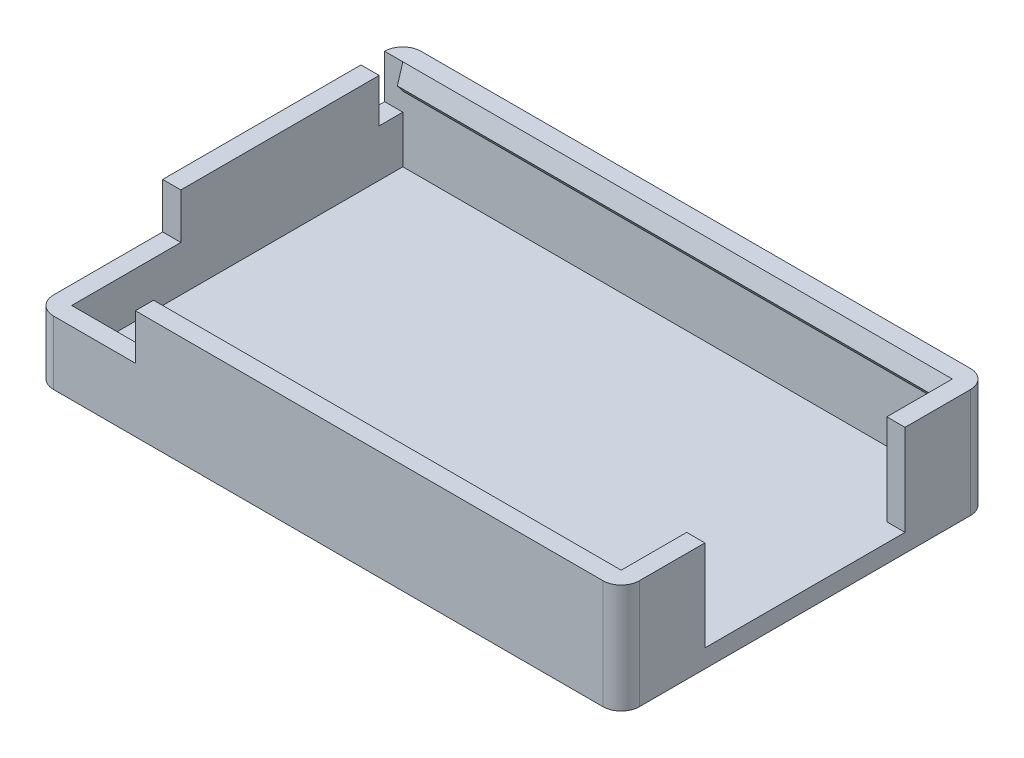
ISO-10303-21;
HEADER;
FILE_DESCRIPTION(('STEP AP214'),'2;1');
FILE_NAME('part.step','',(''),(''),'','','');
FILE_SCHEMA(('AUTOMOTIVE_DESIGN { 1 0 10303 214 1 1 1 1 }'));
ENDSEC;
DATA;
#1=APPLICATION_CONTEXT('core data for automotive mechanical design processes');
#2=APPLICATION_PROTOCOL_DEFINITION('international standard','automotive_design',2000,#1);
#3=PRODUCT_CONTEXT('',#1,'mechanical');
#4=PRODUCT('Part','Part','',(#3));
#5=PRODUCT_RELATED_PRODUCT_CATEGORY('part','',(#4));
#6=PRODUCT_DEFINITION_FORMATION('','',#4);
#7=PRODUCT_DEFINITION_CONTEXT('part definition',#1,'design');
#8=PRODUCT_DEFINITION('design','',#6,#7);
#9=PRODUCT_DEFINITION_SHAPE('','',#8);
#10=(LENGTH_UNIT() NAMED_UNIT(*) SI_UNIT(.MILLI.,.METRE.));
#11=(NAMED_UNIT(*) PLANE_ANGLE_UNIT() SI_UNIT($,.RADIAN.));
#12=(NAMED_UNIT(*) SI_UNIT($,.STERADIAN.) SOLID_ANGLE_UNIT());
#13=UNCERTAINTY_MEASURE_WITH_UNIT(LENGTH_MEASURE(1.E-05),#10,'distance_accuracy_value','');
#14=(GEOMETRIC_REPRESENTATION_CONTEXT(3) GLOBAL_UNCERTAINTY_ASSIGNED_CONTEXT((#13)) GLOBAL_UNIT_ASSIGNED_CONTEXT((#10,
#11,#12)) REPRESENTATION_CONTEXT('',''));
#15=CARTESIAN_POINT('',(0.,0.,0.));
#16=DIRECTION('',(0.,0.,1.));
#17=DIRECTION('',(1.,0.,0.));
#18=AXIS2_PLACEMENT_3D('',#15,#16,#17);
#19=CARTESIAN_POINT('',(-15.1,3.5,9.1));
#20=DIRECTION('',(-1.,0.,0.));
#21=DIRECTION('',(0.,0.,1.));
#22=AXIS2_PLACEMENT_3D('',#19,#20,#21);
#23=PLANE('',#22);
#24=DIRECTION('',(0.,1.,0.));
#25=VECTOR('',#24,1.);
#26=CARTESIAN_POINT('',(-15.1,6.,-7.8));
#27=LINE('',#26,#25);
#28=CARTESIAN_POINT('',(-15.1,3.6,-7.8));
#29=VERTEX_POINT('',#28);
#30=CARTESIAN_POINT('',(-15.1,6.,-7.8));
#31=VERTEX_POINT('',#30);
#32=EDGE_CURVE('E240',#29,#31,#27,.T.);
#33=ORIENTED_EDGE('',*,*,#32,.T.);
#34=DIRECTION('',(0.,0.,-1.));
#35=VECTOR('',#34,1.);
#36=CARTESIAN_POINT('',(-15.1,6.,3.1));
#37=LINE('',#36,#35);
#38=CARTESIAN_POINT('',(-15.1,6.,3.1));
#39=VERTEX_POINT('',#38);
#40=EDGE_CURVE('E361',#39,#31,#37,.T.);
#41=ORIENTED_EDGE('',*,*,#40,.F.);
#42=DIRECTION('',(0.,-1.,0.));
#43=VECTOR('',#42,1.);
#44=CARTESIAN_POINT('',(-15.1,6.,3.1));
#45=LINE('',#44,#43);
#46=CARTESIAN_POINT('',(-15.1,3.5,3.1));
#47=VERTEX_POINT('',#46);
#48=EDGE_CURVE('E371',#39,#47,#45,.T.);
#49=ORIENTED_EDGE('',*,*,#48,.T.);
#50=DIRECTION('',(0.,0.,-1.));
#51=VECTOR('',#50,1.);
#52=CARTESIAN_POINT('',(-15.1,3.5,9.1));
#53=LINE('',#52,#51);
#54=CARTESIAN_POINT('',(-15.1,3.5,9.1));
#55=VERTEX_POINT('',#54);
#56=EDGE_CURVE('E394',#55,#47,#53,.T.);
#57=ORIENTED_EDGE('',*,*,#56,.F.);
#58=DIRECTION('',(0.,-1.,0.));
#59=VECTOR('',#58,1.);
#60=CARTESIAN_POINT('',(-15.1,3.5,9.1));
#61=LINE('',#60,#59);
#62=CARTESIAN_POINT('',(-15.1,1.,9.1));
#63=VERTEX_POINT('',#62);
#64=EDGE_CURVE('E435',#55,#63,#61,.T.);
#65=ORIENTED_EDGE('',*,*,#64,.T.);
#66=DIRECTION('',(0.,0.,-1.));
#67=VECTOR('',#66,1.);
#68=CARTESIAN_POINT('',(-15.1,1.,9.1));
#69=LINE('',#68,#67);
#70=CARTESIAN_POINT('',(-15.1,1.,-9.1));
#71=VERTEX_POINT('',#70);
#72=EDGE_CURVE('E409',#63,#71,#69,.T.);
#73=ORIENTED_EDGE('',*,*,#72,.T.);
#74=DIRECTION('',(0.,-1.,0.));
#75=VECTOR('',#74,1.);
#76=CARTESIAN_POINT('',(-15.1,3.5,-9.1));
#77=LINE('',#76,#75);
#78=CARTESIAN_POINT('',(-15.1,3.6,-9.1));
#79=VERTEX_POINT('',#78);
#80=EDGE_CURVE('E250',#79,#71,#77,.T.);
#81=ORIENTED_EDGE('',*,*,#80,.F.);
#82=DIRECTION('',(0.,0.,1.));
#83=VECTOR('',#82,1.);
#84=CARTESIAN_POINT('',(-15.1,3.6,-7.8));
#85=LINE('',#84,#83);
#86=EDGE_CURVE('E229',#79,#29,#85,.T.);
#87=ORIENTED_EDGE('',*,*,#86,.T.);
#88=EDGE_LOOP('',(#33,#41,#49,#57,#65,#73,#81,#87));
#89=FACE_BOUND('',#88,.T.);
#90=ADVANCED_FACE('F43',(#89),#23,.F.);
#91=CARTESIAN_POINT('',(-16.1,1.,10.1));
#92=DIRECTION('',(1.,0.,0.));
#93=DIRECTION('',(0.,0.,-1.));
#94=AXIS2_PLACEMENT_3D('',#91,#92,#93);
#95=PLANE('',#94);
#96=DIRECTION('',(0.,-1.,0.));
#97=VECTOR('',#96,1.);
#98=CARTESIAN_POINT('',(-16.1,6.,-7.8));
#99=LINE('',#98,#97);
#100=CARTESIAN_POINT('',(-16.1,6.,-7.8));
#101=VERTEX_POINT('',#100);
#102=CARTESIAN_POINT('',(-16.1,3.6,-7.8));
#103=VERTEX_POINT('',#102);
#104=EDGE_CURVE('E236',#101,#103,#99,.T.);
#105=ORIENTED_EDGE('',*,*,#104,.T.);
#106=DIRECTION('',(0.,0.,-1.));
#107=VECTOR('',#106,1.);
#108=CARTESIAN_POINT('',(-16.1,3.6,-7.8));
#109=LINE('',#108,#107);
#110=CARTESIAN_POINT('',(-16.1,3.6,-9.1));
#111=VERTEX_POINT('',#110);
#112=EDGE_CURVE('E232',#103,#111,#109,.T.);
#113=ORIENTED_EDGE('',*,*,#112,.T.);
#114=DIRECTION('',(0.,-1.,0.));
#115=VECTOR('',#114,1.);
#116=CARTESIAN_POINT('',(-16.1,1.,-9.1));
#117=LINE('',#116,#115);
#118=CARTESIAN_POINT('',(-16.1,0.,-9.1));
#119=VERTEX_POINT('',#118);
#120=EDGE_CURVE('E487',#111,#119,#117,.T.);
#121=ORIENTED_EDGE('',*,*,#120,.T.);
#122=DIRECTION('',(0.,0.,1.));
#123=VECTOR('',#122,1.);
#124=CARTESIAN_POINT('',(-16.1,0.,10.1));
#125=LINE('',#124,#123);
#126=CARTESIAN_POINT('',(-16.1,0.,9.1));
#127=VERTEX_POINT('',#126);
#128=EDGE_CURVE('E462',#119,#127,#125,.T.);
#129=ORIENTED_EDGE('',*,*,#128,.T.);
#130=DIRECTION('',(0.,-1.,0.));
#131=VECTOR('',#130,1.);
#132=CARTESIAN_POINT('',(-16.1,1.,9.1));
#133=LINE('',#132,#131);
#134=CARTESIAN_POINT('',(-16.1,3.5,9.1));
#135=VERTEX_POINT('',#134);
#136=EDGE_CURVE('E491',#127,#135,#133,.F.);
#137=ORIENTED_EDGE('',*,*,#136,.T.);
#138=DIRECTION('',(0.,0.,1.));
#139=VECTOR('',#138,1.);
#140=CARTESIAN_POINT('',(-16.1,3.5,-10.1));
#141=LINE('',#140,#139);
#142=CARTESIAN_POINT('',(-16.1,3.5,3.1));
#143=VERTEX_POINT('',#142);
#144=EDGE_CURVE('E383',#143,#135,#141,.T.);
#145=ORIENTED_EDGE('',*,*,#144,.F.);
#146=DIRECTION('',(0.,-1.,0.));
#147=VECTOR('',#146,1.);
#148=CARTESIAN_POINT('',(-16.1,6.,3.1));
#149=LINE('',#148,#147);
#150=CARTESIAN_POINT('',(-16.1,6.,3.1));
#151=VERTEX_POINT('',#150);
#152=EDGE_CURVE('E378',#151,#143,#149,.T.);
#153=ORIENTED_EDGE('',*,*,#152,.F.);
#154=DIRECTION('',(0.,0.,1.));
#155=VECTOR('',#154,1.);
#156=CARTESIAN_POINT('',(-16.1,6.,-10.1));
#157=LINE('',#156,#155);
#158=EDGE_CURVE('E355',#101,#151,#157,.T.);
#159=ORIENTED_EDGE('',*,*,#158,.F.);
#160=EDGE_LOOP('',(#105,#113,#121,#129,#137,#145,#153,#159));
#161=FACE_BOUND('',#160,.T.);
#162=ADVANCED_FACE('F542',(#161),#95,.F.);
#163=CARTESIAN_POINT('',(0.,6.,0.));
#164=DIRECTION('',(0.,1.,0.));
#165=DIRECTION('',(0.,0.,1.));
#166=AXIS2_PLACEMENT_3D('',#163,#164,#165);
#167=PLANE('',#166);
#168=CARTESIAN_POINT('',(-15.1,6.,-9.1));
#169=DIRECTION('',(0.,1.,0.));
#170=DIRECTION('',(0.,0.,1.));
#171=AXIS2_PLACEMENT_3D('',#168,#169,#170);
#172=CIRCLE('',#171,1.);
#173=CARTESIAN_POINT('',(-15.1,6.,-10.1));
#174=VERTEX_POINT('',#173);
#175=CARTESIAN_POINT('',(-16.1,6.,-9.1));
#176=VERTEX_POINT('',#175);
#177=EDGE_CURVE('E507',#174,#176,#172,.T.);
#178=ORIENTED_EDGE('',*,*,#177,.T.);
#179=DIRECTION('',(1.,0.,0.));
#180=VECTOR('',#179,1.);
#181=CARTESIAN_POINT('',(-18.8294688127912,6.,-9.1));
#182=LINE('',#181,#180);
#183=CARTESIAN_POINT('',(-15.1,6.,-9.1));
#184=VERTEX_POINT('',#183);
#185=EDGE_CURVE('E261',#176,#184,#182,.T.);
#186=ORIENTED_EDGE('',*,*,#185,.T.);
#187=DIRECTION('',(1.,0.,0.));
#188=VECTOR('',#187,1.);
#189=CARTESIAN_POINT('',(-15.1,6.,-9.1));
#190=LINE('',#189,#188);
#191=CARTESIAN_POINT('',(15.1,6.,-9.1));
#192=VERTEX_POINT('',#191);
#193=EDGE_CURVE('E364',#184,#192,#190,.T.);
#194=ORIENTED_EDGE('',*,*,#193,.T.);
#195=DIRECTION('',(0.,0.,1.));
#196=VECTOR('',#195,1.);
#197=CARTESIAN_POINT('',(15.1,6.,-9.1));
#198=LINE('',#197,#196);
#199=CARTESIAN_POINT('',(15.1,6.,-5.5));
#200=VERTEX_POINT('',#199);
#201=EDGE_CURVE('E367',#192,#200,#198,.T.);
#202=ORIENTED_EDGE('',*,*,#201,.T.);
#203=DIRECTION('',(1.,0.,0.));
#204=VECTOR('',#203,1.);
#205=CARTESIAN_POINT('',(15.1,6.,-5.5));
#206=LINE('',#205,#204);
#207=CARTESIAN_POINT('',(16.1,6.,-5.5));
#208=VERTEX_POINT('',#207);
#209=EDGE_CURVE('E344',#200,#208,#206,.T.);
#210=ORIENTED_EDGE('',*,*,#209,.T.);
#211=DIRECTION('',(0.,0.,-1.));
#212=VECTOR('',#211,1.);
#213=CARTESIAN_POINT('',(16.1,6.,-5.5));
#214=LINE('',#213,#212);
#215=CARTESIAN_POINT('',(16.1,6.,-9.1));
#216=VERTEX_POINT('',#215);
#217=EDGE_CURVE('E348',#208,#216,#214,.T.);
#218=ORIENTED_EDGE('',*,*,#217,.T.);
#219=CARTESIAN_POINT('',(15.1,6.,-9.1));
#220=DIRECTION('',(0.,1.,0.));
#221=DIRECTION('',(0.,0.,1.));
#222=AXIS2_PLACEMENT_3D('',#219,#220,#221);
#223=CIRCLE('',#222,1.);
#224=CARTESIAN_POINT('',(15.1,6.,-10.1));
#225=VERTEX_POINT('',#224);
#226=EDGE_CURVE('E504',#216,#225,#223,.T.);
#227=ORIENTED_EDGE('',*,*,#226,.T.);
#228=DIRECTION('',(-1.,0.,0.));
#229=VECTOR('',#228,1.);
#230=CARTESIAN_POINT('',(16.1,6.,-10.1));
#231=LINE('',#230,#229);
#232=EDGE_CURVE('E351',#225,#174,#231,.T.);
#233=ORIENTED_EDGE('',*,*,#232,.T.);
#234=EDGE_LOOP('',(#178,#186,#194,#202,#210,#218,#227,#233));
#235=FACE_BOUND('',#234,.T.);
#236=ADVANCED_FACE('F532',(#235),#167,.T.);
#237=ORIENTED_EDGE('',*,*,#40,.T.);
#238=DIRECTION('',(1.,0.,0.));
#239=VECTOR('',#238,1.);
#240=CARTESIAN_POINT('',(-18.8294688127912,6.,-7.8));
#241=LINE('',#240,#239);
#242=EDGE_CURVE('E237',#101,#31,#241,.T.);
#243=ORIENTED_EDGE('',*,*,#242,.F.);
#244=ORIENTED_EDGE('',*,*,#158,.T.);
#245=DIRECTION('',(1.,0.,0.));
#246=VECTOR('',#245,1.);
#247=CARTESIAN_POINT('',(-16.1,6.,3.1));
#248=LINE('',#247,#246);
#249=EDGE_CURVE('E358',#151,#39,#248,.T.);
#250=ORIENTED_EDGE('',*,*,#249,.T.);
#251=EDGE_LOOP('',(#237,#243,#244,#250));
#252=FACE_BOUND('',#251,.T.);
#253=ADVANCED_FACE('F549',(#252),#167,.T.);
#254=CARTESIAN_POINT('',(-15.1,3.5,-9.1));
#255=DIRECTION('',(0.,0.,-1.));
#256=DIRECTION('',(-1.,0.,0.));
#257=AXIS2_PLACEMENT_3D('',#254,#255,#256);
#258=PLANE('',#257);
#259=DIRECTION('',(-1.,0.,0.));
#260=VECTOR('',#259,1.);
#261=CARTESIAN_POINT('',(16.5317821063276,4.6,-9.10000000000001));
#262=LINE('',#261,#260);
#263=CARTESIAN_POINT('',(15.1,4.6,-9.10000000000001));
#264=VERTEX_POINT('',#263);
#265=CARTESIAN_POINT('',(-15.1,4.60000000000001,-9.1));
#266=VERTEX_POINT('',#265);
#267=EDGE_CURVE('E283',#264,#266,#262,.T.);
#268=ORIENTED_EDGE('',*,*,#267,.T.);
#269=DIRECTION('',(0.,-1.,0.));
#270=VECTOR('',#269,1.);
#271=CARTESIAN_POINT('',(-15.1,3.6,-9.1));
#272=LINE('',#271,#270);
#273=EDGE_CURVE('E247',#184,#266,#272,.T.);
#274=ORIENTED_EDGE('',*,*,#273,.F.);
#275=ORIENTED_EDGE('',*,*,#185,.F.);
#276=EDGE_CURVE('E488',#176,#111,#117,.T.);
#277=ORIENTED_EDGE('',*,*,#276,.T.);
#278=DIRECTION('',(1.,0.,0.));
#279=VECTOR('',#278,1.);
#280=CARTESIAN_POINT('',(-18.8294688127912,3.6,-9.1));
#281=LINE('',#280,#279);
#282=EDGE_CURVE('E258',#111,#79,#281,.T.);
#283=ORIENTED_EDGE('',*,*,#282,.T.);
#284=ORIENTED_EDGE('',*,*,#80,.T.);
#285=DIRECTION('',(1.,0.,0.));
#286=VECTOR('',#285,1.);
#287=CARTESIAN_POINT('',(-15.1,1.,-9.1));
#288=LINE('',#287,#286);
#289=CARTESIAN_POINT('',(15.1,1.,-9.1));
#290=VERTEX_POINT('',#289);
#291=EDGE_CURVE('E412',#71,#290,#288,.T.);
#292=ORIENTED_EDGE('',*,*,#291,.T.);
#293=DIRECTION('',(0.,-1.,0.));
#294=VECTOR('',#293,1.);
#295=CARTESIAN_POINT('',(15.1,3.5,-9.1));
#296=LINE('',#295,#294);
#297=EDGE_CURVE('E430',#264,#290,#296,.T.);
#298=ORIENTED_EDGE('',*,*,#297,.F.);
#299=EDGE_LOOP('',(#268,#274,#275,#277,#283,#284,#292,#298));
#300=FACE_BOUND('',#299,.T.);
#301=ADVANCED_FACE('F539',(#300),#258,.F.);
#302=CARTESIAN_POINT('',(15.1,3.5,-5.5));
#303=DIRECTION('',(1.,0.,0.));
#304=DIRECTION('',(0.,0.,-1.));
#305=AXIS2_PLACEMENT_3D('',#302,#303,#304);
#306=PLANE('',#305);
#307=DIRECTION('',(0.,-0.799999999999993,-0.600000000000009));
#308=VECTOR('',#307,1.);
#309=CARTESIAN_POINT('',(15.1,5.,-8.8));
#310=LINE('',#309,#308);
#311=CARTESIAN_POINT('',(15.1,5.,-8.8));
#312=VERTEX_POINT('',#311);
#313=EDGE_CURVE('E274',#312,#264,#310,.T.);
#314=ORIENTED_EDGE('',*,*,#313,.T.);
#315=ORIENTED_EDGE('',*,*,#297,.T.);
#316=DIRECTION('',(0.,0.,1.));
#317=VECTOR('',#316,1.);
#318=CARTESIAN_POINT('',(15.1,1.,-5.5));
#319=LINE('',#318,#317);
#320=CARTESIAN_POINT('',(15.1,1.,-5.5));
#321=VERTEX_POINT('',#320);
#322=EDGE_CURVE('E416',#290,#321,#319,.T.);
#323=ORIENTED_EDGE('',*,*,#322,.T.);
#324=DIRECTION('',(0.,-1.,0.));
#325=VECTOR('',#324,1.);
#326=CARTESIAN_POINT('',(15.1,3.5,-5.5));
#327=LINE('',#326,#325);
#328=EDGE_CURVE('E426',#200,#321,#327,.T.);
#329=ORIENTED_EDGE('',*,*,#328,.F.);
#330=ORIENTED_EDGE('',*,*,#201,.F.);
#331=DIRECTION('',(0.,-0.95782628522115,0.28734788556635));
#332=VECTOR('',#331,1.);
#333=CARTESIAN_POINT('',(15.1,6.,-9.1));
#334=LINE('',#333,#332);
#335=EDGE_CURVE('E279',#192,#312,#334,.T.);
#336=ORIENTED_EDGE('',*,*,#335,.T.);
#337=EDGE_LOOP('',(#314,#315,#323,#329,#330,#336));
#338=FACE_BOUND('',#337,.T.);
#339=ADVANCED_FACE('F587',(#338),#306,.F.);
#340=CARTESIAN_POINT('',(15.1,3.5,9.1));
#341=DIRECTION('',(1.,0.,0.));
#342=DIRECTION('',(0.,0.,-1.));
#343=AXIS2_PLACEMENT_3D('',#340,#341,#342);
#344=PLANE('',#343);
#345=DIRECTION('',(0.,0.799999999999993,-0.600000000000009));
#346=VECTOR('',#345,1.);
#347=CARTESIAN_POINT('',(15.1,5.,8.8));
#348=LINE('',#347,#346);
#349=CARTESIAN_POINT('',(15.1,4.6,9.10000000000001));
#350=VERTEX_POINT('',#349);
#351=CARTESIAN_POINT('',(15.1,5.,8.8));
#352=VERTEX_POINT('',#351);
#353=EDGE_CURVE('E298',#350,#352,#348,.T.);
#354=ORIENTED_EDGE('',*,*,#353,.T.);
#355=DIRECTION('',(0.,0.95782628522115,0.28734788556635));
#356=VECTOR('',#355,1.);
#357=CARTESIAN_POINT('',(15.1,6.,9.1));
#358=LINE('',#357,#356);
#359=CARTESIAN_POINT('',(15.1,6.,9.1));
#360=VERTEX_POINT('',#359);
#361=EDGE_CURVE('E303',#352,#360,#358,.T.);
#362=ORIENTED_EDGE('',*,*,#361,.T.);
#363=DIRECTION('',(0.,0.,1.));
#364=VECTOR('',#363,1.);
#365=CARTESIAN_POINT('',(15.1,6.,5.5));
#366=LINE('',#365,#364);
#367=CARTESIAN_POINT('',(15.1,6.,5.5));
#368=VERTEX_POINT('',#367);
#369=EDGE_CURVE('E329',#368,#360,#366,.T.);
#370=ORIENTED_EDGE('',*,*,#369,.F.);
#371=DIRECTION('',(0.,-1.,0.));
#372=VECTOR('',#371,1.);
#373=CARTESIAN_POINT('',(15.1,3.5,5.5));
#374=LINE('',#373,#372);
#375=CARTESIAN_POINT('',(15.1,1.,5.5));
#376=VERTEX_POINT('',#375);
#377=EDGE_CURVE('E442',#368,#376,#374,.T.);
#378=ORIENTED_EDGE('',*,*,#377,.T.);
#379=DIRECTION('',(0.,0.,1.));
#380=VECTOR('',#379,1.);
#381=CARTESIAN_POINT('',(15.1,1.,9.1));
#382=LINE('',#381,#380);
#383=CARTESIAN_POINT('',(15.1,1.,9.1));
#384=VERTEX_POINT('',#383);
#385=EDGE_CURVE('E401',#376,#384,#382,.T.);
#386=ORIENTED_EDGE('',*,*,#385,.T.);
#387=DIRECTION('',(0.,-1.,0.));
#388=VECTOR('',#387,1.);
#389=CARTESIAN_POINT('',(15.1,3.5,9.1));
#390=LINE('',#389,#388);
#391=EDGE_CURVE('E439',#350,#384,#390,.T.);
#392=ORIENTED_EDGE('',*,*,#391,.F.);
#393=EDGE_LOOP('',(#354,#362,#370,#378,#386,#392));
#394=FACE_BOUND('',#393,.T.);
#395=ADVANCED_FACE('F609',(#394),#344,.F.);
#396=CARTESIAN_POINT('',(-15.1,3.5,9.1));
#397=DIRECTION('',(0.,0.,1.));
#398=DIRECTION('',(1.,0.,0.));
#399=AXIS2_PLACEMENT_3D('',#396,#397,#398);
#400=PLANE('',#399);
#401=DIRECTION('',(-1.,0.,0.));
#402=VECTOR('',#401,1.);
#403=CARTESIAN_POINT('',(16.5317821063276,4.6,9.10000000000001));
#404=LINE('',#403,#402);
#405=CARTESIAN_POINT('',(-10.6,4.6,9.10000000000001));
#406=VERTEX_POINT('',#405);
#407=EDGE_CURVE('E297',#350,#406,#404,.T.);
#408=ORIENTED_EDGE('',*,*,#407,.F.);
#409=ORIENTED_EDGE('',*,*,#391,.T.);
#410=DIRECTION('',(-1.,0.,0.));
#411=VECTOR('',#410,1.);
#412=CARTESIAN_POINT('',(-15.1,1.,9.1));
#413=LINE('',#412,#411);
#414=EDGE_CURVE('E405',#384,#63,#413,.T.);
#415=ORIENTED_EDGE('',*,*,#414,.T.);
#416=ORIENTED_EDGE('',*,*,#64,.F.);
#417=DIRECTION('',(-1.,0.,0.));
#418=VECTOR('',#417,1.);
#419=CARTESIAN_POINT('',(-15.1,3.5,9.1));
#420=LINE('',#419,#418);
#421=CARTESIAN_POINT('',(-10.6,3.5,9.1));
#422=VERTEX_POINT('',#421);
#423=EDGE_CURVE('E391',#422,#55,#420,.T.);
#424=ORIENTED_EDGE('',*,*,#423,.F.);
#425=DIRECTION('',(0.,-1.,0.));
#426=VECTOR('',#425,1.);
#427=CARTESIAN_POINT('',(-10.6,6.,9.1));
#428=LINE('',#427,#426);
#429=EDGE_CURVE('E340',#406,#422,#428,.T.);
#430=ORIENTED_EDGE('',*,*,#429,.F.);
#431=EDGE_LOOP('',(#408,#409,#415,#416,#424,#430));
#432=FACE_BOUND('',#431,.T.);
#433=ADVANCED_FACE('F578',(#432),#400,.F.);
#434=CARTESIAN_POINT('',(0.,3.5,0.));
#435=DIRECTION('',(0.,-1.,0.));
#436=DIRECTION('',(0.,0.,-1.));
#437=AXIS2_PLACEMENT_3D('',#434,#435,#436);
#438=PLANE('',#437);
#439=ORIENTED_EDGE('',*,*,#144,.T.);
#440=CARTESIAN_POINT('',(-15.1,3.5,9.1));
#441=DIRECTION('',(0.,-1.,0.));
#442=DIRECTION('',(0.,0.,-1.));
#443=AXIS2_PLACEMENT_3D('',#440,#441,#442);
#444=CIRCLE('',#443,1.);
#445=CARTESIAN_POINT('',(-15.1,3.5,10.1));
#446=VERTEX_POINT('',#445);
#447=EDGE_CURVE('E494',#135,#446,#444,.F.);
#448=ORIENTED_EDGE('',*,*,#447,.T.);
#449=DIRECTION('',(1.,0.,0.));
#450=VECTOR('',#449,1.);
#451=CARTESIAN_POINT('',(-16.1,3.5,10.1));
#452=LINE('',#451,#450);
#453=CARTESIAN_POINT('',(-10.6,3.5,10.1));
#454=VERTEX_POINT('',#453);
#455=EDGE_CURVE('E387',#446,#454,#452,.T.);
#456=ORIENTED_EDGE('',*,*,#455,.T.);
#457=DIRECTION('',(0.,0.,1.));
#458=VECTOR('',#457,1.);
#459=CARTESIAN_POINT('',(-10.6,3.5,9.1));
#460=LINE('',#459,#458);
#461=EDGE_CURVE('E302',#422,#454,#460,.T.);
#462=ORIENTED_EDGE('',*,*,#461,.F.);
#463=ORIENTED_EDGE('',*,*,#423,.T.);
#464=ORIENTED_EDGE('',*,*,#56,.T.);
#465=DIRECTION('',(1.,0.,0.));
#466=VECTOR('',#465,1.);
#467=CARTESIAN_POINT('',(-16.1,3.5,3.1));
#468=LINE('',#467,#466);
#469=EDGE_CURVE('E343',#143,#47,#468,.T.);
#470=ORIENTED_EDGE('',*,*,#469,.F.);
#471=EDGE_LOOP('',(#439,#448,#456,#462,#463,#464,#470));
#472=FACE_BOUND('',#471,.T.);
#473=ADVANCED_FACE('F557',(#472),#438,.F.);
#474=CARTESIAN_POINT('',(0.,1.,0.));
#475=DIRECTION('',(0.,-1.,0.));
#476=DIRECTION('',(0.,0.,-1.));
#477=AXIS2_PLACEMENT_3D('',#474,#475,#476);
#478=PLANE('',#477);
#479=DIRECTION('',(1.,0.,0.));
#480=VECTOR('',#479,1.);
#481=CARTESIAN_POINT('',(15.1,1.,-5.5));
#482=LINE('',#481,#480);
#483=CARTESIAN_POINT('',(16.1,1.,-5.5));
#484=VERTEX_POINT('',#483);
#485=EDGE_CURVE('E388',#321,#484,#482,.T.);
#486=ORIENTED_EDGE('',*,*,#485,.F.);
#487=ORIENTED_EDGE('',*,*,#322,.F.);
#488=ORIENTED_EDGE('',*,*,#291,.F.);
#489=ORIENTED_EDGE('',*,*,#72,.F.);
#490=ORIENTED_EDGE('',*,*,#414,.F.);
#491=ORIENTED_EDGE('',*,*,#385,.F.);
#492=DIRECTION('',(-1.,0.,0.));
#493=VECTOR('',#492,1.);
#494=CARTESIAN_POINT('',(15.1,1.,5.5));
#495=LINE('',#494,#493);
#496=CARTESIAN_POINT('',(16.1,1.,5.5));
#497=VERTEX_POINT('',#496);
#498=EDGE_CURVE('E382',#497,#376,#495,.T.);
#499=ORIENTED_EDGE('',*,*,#498,.F.);
#500=DIRECTION('',(0.,0.,-1.));
#501=VECTOR('',#500,1.);
#502=CARTESIAN_POINT('',(16.1,1.,10.1));
#503=LINE('',#502,#501);
#504=EDGE_CURVE('E451',#497,#484,#503,.T.);
#505=ORIENTED_EDGE('',*,*,#504,.T.);
#506=EDGE_LOOP('',(#486,#487,#488,#489,#490,#491,#499,#505));
#507=FACE_BOUND('',#506,.T.);
#508=ADVANCED_FACE('F582',(#507),#478,.F.);
#509=CARTESIAN_POINT('',(16.1,1.,10.1));
#510=DIRECTION('',(-1.,0.,0.));
#511=DIRECTION('',(0.,0.,1.));
#512=AXIS2_PLACEMENT_3D('',#509,#510,#511);
#513=PLANE('',#512);
#514=DIRECTION('',(0.,0.,-1.));
#515=VECTOR('',#514,1.);
#516=CARTESIAN_POINT('',(16.1,6.,10.1));
#517=LINE('',#516,#515);
#518=CARTESIAN_POINT('',(16.1,6.,9.1));
#519=VERTEX_POINT('',#518);
#520=CARTESIAN_POINT('',(16.1,6.,5.5));
#521=VERTEX_POINT('',#520);
#522=EDGE_CURVE('E322',#519,#521,#517,.T.);
#523=ORIENTED_EDGE('',*,*,#522,.F.);
#524=DIRECTION('',(0.,-1.,0.));
#525=VECTOR('',#524,1.);
#526=CARTESIAN_POINT('',(16.1,1.,9.1));
#527=LINE('',#526,#525);
#528=CARTESIAN_POINT('',(16.1,0.,9.1));
#529=VERTEX_POINT('',#528);
#530=EDGE_CURVE('E52',#519,#529,#527,.T.);
#531=ORIENTED_EDGE('',*,*,#530,.T.);
#532=DIRECTION('',(0.,0.,-1.));
#533=VECTOR('',#532,1.);
#534=CARTESIAN_POINT('',(16.1,0.,10.1));
#535=LINE('',#534,#533);
#536=CARTESIAN_POINT('',(16.1,0.,-9.1));
#537=VERTEX_POINT('',#536);
#538=EDGE_CURVE('E450',#529,#537,#535,.T.);
#539=ORIENTED_EDGE('',*,*,#538,.T.);
#540=DIRECTION('',(0.,-1.,0.));
#541=VECTOR('',#540,1.);
#542=CARTESIAN_POINT('',(16.1,1.,-9.1));
#543=LINE('',#542,#541);
#544=EDGE_CURVE('E65',#537,#216,#543,.F.);
#545=ORIENTED_EDGE('',*,*,#544,.T.);
#546=ORIENTED_EDGE('',*,*,#217,.F.);
#547=DIRECTION('',(0.,-1.,0.));
#548=VECTOR('',#547,1.);
#549=CARTESIAN_POINT('',(16.1,3.5,-5.5));
#550=LINE('',#549,#548);
#551=EDGE_CURVE('E397',#208,#484,#550,.T.);
#552=ORIENTED_EDGE('',*,*,#551,.T.);
#553=ORIENTED_EDGE('',*,*,#504,.F.);
#554=DIRECTION('',(0.,-1.,0.));
#555=VECTOR('',#554,1.);
#556=CARTESIAN_POINT('',(16.1,3.5,5.5));
#557=LINE('',#556,#555);
#558=EDGE_CURVE('E446',#521,#497,#557,.T.);
#559=ORIENTED_EDGE('',*,*,#558,.F.);
#560=EDGE_LOOP('',(#523,#531,#539,#545,#546,#552,#553,#559));
#561=FACE_BOUND('',#560,.T.);
#562=ADVANCED_FACE('F516',(#561),#513,.F.);
#563=CARTESIAN_POINT('',(-16.1,1.,-10.1));
#564=DIRECTION('',(0.,0.,1.));
#565=DIRECTION('',(1.,0.,0.));
#566=AXIS2_PLACEMENT_3D('',#563,#564,#565);
#567=PLANE('',#566);
#568=DIRECTION('',(-1.,0.,0.));
#569=VECTOR('',#568,1.);
#570=CARTESIAN_POINT('',(-16.1,0.,-10.1));
#571=LINE('',#570,#569);
#572=CARTESIAN_POINT('',(15.1,0.,-10.1));
#573=VERTEX_POINT('',#572);
#574=CARTESIAN_POINT('',(-15.1,0.,-10.1));
#575=VERTEX_POINT('',#574);
#576=EDGE_CURVE('E458',#573,#575,#571,.T.);
#577=ORIENTED_EDGE('',*,*,#576,.T.);
#578=DIRECTION('',(0.,-1.,0.));
#579=VECTOR('',#578,1.);
#580=CARTESIAN_POINT('',(-15.1,1.,-10.1));
#581=LINE('',#580,#579);
#582=EDGE_CURVE('E501',#575,#174,#581,.F.);
#583=ORIENTED_EDGE('',*,*,#582,.T.);
#584=ORIENTED_EDGE('',*,*,#232,.F.);
#585=DIRECTION('',(0.,-1.,0.));
#586=VECTOR('',#585,1.);
#587=CARTESIAN_POINT('',(15.1,1.,-10.1));
#588=LINE('',#587,#586);
#589=EDGE_CURVE('E497',#225,#573,#588,.T.);
#590=ORIENTED_EDGE('',*,*,#589,.T.);
#591=EDGE_LOOP('',(#577,#583,#584,#590));
#592=FACE_BOUND('',#591,.T.);
#593=ADVANCED_FACE('F528',(#592),#567,.F.);
#594=CARTESIAN_POINT('',(-16.1,1.,10.1));
#595=DIRECTION('',(0.,0.,-1.));
#596=DIRECTION('',(-1.,0.,0.));
#597=AXIS2_PLACEMENT_3D('',#594,#595,#596);
#598=PLANE('',#597);
#599=ORIENTED_EDGE('',*,*,#455,.F.);
#600=DIRECTION('',(0.,-1.,0.));
#601=VECTOR('',#600,1.);
#602=CARTESIAN_POINT('',(-15.1,1.,10.1));
#603=LINE('',#602,#601);
#604=CARTESIAN_POINT('',(-15.1,0.,10.1));
#605=VERTEX_POINT('',#604);
#606=EDGE_CURVE('E471',#446,#605,#603,.T.);
#607=ORIENTED_EDGE('',*,*,#606,.T.);
#608=DIRECTION('',(1.,0.,0.));
#609=VECTOR('',#608,1.);
#610=CARTESIAN_POINT('',(-16.1,0.,10.1));
#611=LINE('',#610,#609);
#612=CARTESIAN_POINT('',(15.1,0.,10.1));
#613=VERTEX_POINT('',#612);
#614=EDGE_CURVE('E455',#605,#613,#611,.T.);
#615=ORIENTED_EDGE('',*,*,#614,.T.);
#616=DIRECTION('',(0.,-1.,0.));
#617=VECTOR('',#616,1.);
#618=CARTESIAN_POINT('',(15.1,1.,10.1));
#619=LINE('',#618,#617);
#620=CARTESIAN_POINT('',(15.1,6.,10.1));
#621=VERTEX_POINT('',#620);
#622=EDGE_CURVE('E454',#613,#621,#619,.F.);
#623=ORIENTED_EDGE('',*,*,#622,.T.);
#624=DIRECTION('',(1.,0.,0.));
#625=VECTOR('',#624,1.);
#626=CARTESIAN_POINT('',(-10.6,6.,10.1));
#627=LINE('',#626,#625);
#628=CARTESIAN_POINT('',(-10.6,6.,10.1));
#629=VERTEX_POINT('',#628);
#630=EDGE_CURVE('E319',#629,#621,#627,.T.);
#631=ORIENTED_EDGE('',*,*,#630,.F.);
#632=DIRECTION('',(0.,-1.,0.));
#633=VECTOR('',#632,1.);
#634=CARTESIAN_POINT('',(-10.6,6.,10.1));
#635=LINE('',#634,#633);
#636=EDGE_CURVE('E333',#629,#454,#635,.T.);
#637=ORIENTED_EDGE('',*,*,#636,.T.);
#638=EDGE_LOOP('',(#599,#607,#615,#623,#631,#637));
#639=FACE_BOUND('',#638,.T.);
#640=ADVANCED_FACE('F567',(#639),#598,.F.);
#641=CARTESIAN_POINT('',(0.,0.,0.));
#642=DIRECTION('',(0.,-1.,0.));
#643=DIRECTION('',(0.,0.,-1.));
#644=AXIS2_PLACEMENT_3D('',#641,#642,#643);
#645=PLANE('',#644);
#646=ORIENTED_EDGE('',*,*,#614,.F.);
#647=CARTESIAN_POINT('',(-15.1,0.,9.1));
#648=DIRECTION('',(0.,-1.,0.));
#649=DIRECTION('',(0.,0.,-1.));
#650=AXIS2_PLACEMENT_3D('',#647,#648,#649);
#651=CIRCLE('',#650,1.);
#652=EDGE_CURVE('E484',#605,#127,#651,.T.);
#653=ORIENTED_EDGE('',*,*,#652,.T.);
#654=ORIENTED_EDGE('',*,*,#128,.F.);
#655=CARTESIAN_POINT('',(-15.1,0.,-9.1));
#656=DIRECTION('',(0.,-1.,0.));
#657=DIRECTION('',(0.,0.,-1.));
#658=AXIS2_PLACEMENT_3D('',#655,#656,#657);
#659=CIRCLE('',#658,1.);
#660=EDGE_CURVE('E481',#119,#575,#659,.T.);
#661=ORIENTED_EDGE('',*,*,#660,.T.);
#662=ORIENTED_EDGE('',*,*,#576,.F.);
#663=CARTESIAN_POINT('',(15.1,0.,-9.1));
#664=DIRECTION('',(0.,-1.,0.));
#665=DIRECTION('',(0.,0.,-1.));
#666=AXIS2_PLACEMENT_3D('',#663,#664,#665);
#667=CIRCLE('',#666,1.);
#668=EDGE_CURVE('E475',#573,#537,#667,.T.);
#669=ORIENTED_EDGE('',*,*,#668,.T.);
#670=ORIENTED_EDGE('',*,*,#538,.F.);
#671=CARTESIAN_POINT('',(15.1,0.,9.1));
#672=DIRECTION('',(0.,-1.,0.));
#673=DIRECTION('',(0.,0.,-1.));
#674=AXIS2_PLACEMENT_3D('',#671,#672,#673);
#675=CIRCLE('',#674,1.);
#676=EDGE_CURVE('E478',#529,#613,#675,.T.);
#677=ORIENTED_EDGE('',*,*,#676,.T.);
#678=EDGE_LOOP('',(#646,#653,#654,#661,#662,#669,#670,#677));
#679=FACE_BOUND('',#678,.T.);
#680=ADVANCED_FACE('F521',(#679),#645,.T.);
#681=CARTESIAN_POINT('',(15.1,3.5,5.5));
#682=DIRECTION('',(0.,0.,1.));
#683=DIRECTION('',(1.,0.,0.));
#684=AXIS2_PLACEMENT_3D('',#681,#682,#683);
#685=PLANE('',#684);
#686=ORIENTED_EDGE('',*,*,#498,.T.);
#687=ORIENTED_EDGE('',*,*,#377,.F.);
#688=DIRECTION('',(-1.,0.,0.));
#689=VECTOR('',#688,1.);
#690=CARTESIAN_POINT('',(16.1,6.,5.5));
#691=LINE('',#690,#689);
#692=EDGE_CURVE('E325',#521,#368,#691,.T.);
#693=ORIENTED_EDGE('',*,*,#692,.F.);
#694=ORIENTED_EDGE('',*,*,#558,.T.);
#695=EDGE_LOOP('',(#686,#687,#693,#694));
#696=FACE_BOUND('',#695,.T.);
#697=ADVANCED_FACE('F605',(#696),#685,.F.);
#698=CARTESIAN_POINT('',(15.1,3.5,-5.5));
#699=DIRECTION('',(0.,0.,-1.));
#700=DIRECTION('',(-1.,0.,0.));
#701=AXIS2_PLACEMENT_3D('',#698,#699,#700);
#702=PLANE('',#701);
#703=ORIENTED_EDGE('',*,*,#485,.T.);
#704=ORIENTED_EDGE('',*,*,#551,.F.);
#705=ORIENTED_EDGE('',*,*,#209,.F.);
#706=ORIENTED_EDGE('',*,*,#328,.T.);
#707=EDGE_LOOP('',(#703,#704,#705,#706));
#708=FACE_BOUND('',#707,.T.);
#709=ADVANCED_FACE('F601',(#708),#702,.F.);
#710=CARTESIAN_POINT('',(-16.1,6.,3.1));
#711=DIRECTION('',(0.,0.,-1.));
#712=DIRECTION('',(-1.,0.,0.));
#713=AXIS2_PLACEMENT_3D('',#710,#711,#712);
#714=PLANE('',#713);
#715=ORIENTED_EDGE('',*,*,#469,.T.);
#716=ORIENTED_EDGE('',*,*,#48,.F.);
#717=ORIENTED_EDGE('',*,*,#249,.F.);
#718=ORIENTED_EDGE('',*,*,#152,.T.);
#719=EDGE_LOOP('',(#715,#716,#717,#718));
#720=FACE_BOUND('',#719,.T.);
#721=ADVANCED_FACE('F554',(#720),#714,.F.);
#722=CARTESIAN_POINT('',(-10.6,6.,9.1));
#723=DIRECTION('',(1.,0.,0.));
#724=DIRECTION('',(0.,0.,-1.));
#725=AXIS2_PLACEMENT_3D('',#722,#723,#724);
#726=PLANE('',#725);
#727=ORIENTED_EDGE('',*,*,#461,.T.);
#728=ORIENTED_EDGE('',*,*,#636,.F.);
#729=DIRECTION('',(0.,0.,1.));
#730=VECTOR('',#729,1.);
#731=CARTESIAN_POINT('',(-10.6,6.,9.1));
#732=LINE('',#731,#730);
#733=CARTESIAN_POINT('',(-10.6,6.,9.1));
#734=VERTEX_POINT('',#733);
#735=EDGE_CURVE('E316',#734,#629,#732,.T.);
#736=ORIENTED_EDGE('',*,*,#735,.F.);
#737=DIRECTION('',(0.,-0.95782628522115,-0.28734788556635));
#738=VECTOR('',#737,1.);
#739=CARTESIAN_POINT('',(-10.6,6.,9.1));
#740=LINE('',#739,#738);
#741=CARTESIAN_POINT('',(-10.6,5.,8.8));
#742=VERTEX_POINT('',#741);
#743=EDGE_CURVE('E293',#734,#742,#740,.T.);
#744=ORIENTED_EDGE('',*,*,#743,.T.);
#745=DIRECTION('',(0.,-0.799999999999994,0.600000000000009));
#746=VECTOR('',#745,1.);
#747=CARTESIAN_POINT('',(-10.6,5.,8.8));
#748=LINE('',#747,#746);
#749=EDGE_CURVE('E278',#742,#406,#748,.T.);
#750=ORIENTED_EDGE('',*,*,#749,.T.);
#751=ORIENTED_EDGE('',*,*,#429,.T.);
#752=EDGE_LOOP('',(#727,#728,#736,#744,#750,#751));
#753=FACE_BOUND('',#752,.T.);
#754=ADVANCED_FACE('F572',(#753),#726,.F.);
#755=CARTESIAN_POINT('',(0.,6.,0.));
#756=DIRECTION('',(0.,1.,0.));
#757=DIRECTION('',(0.,0.,1.));
#758=AXIS2_PLACEMENT_3D('',#755,#756,#757);
#759=PLANE('',#758);
#760=ORIENTED_EDGE('',*,*,#630,.T.);
#761=CARTESIAN_POINT('',(15.1,6.,9.1));
#762=DIRECTION('',(0.,1.,0.));
#763=DIRECTION('',(0.,0.,1.));
#764=AXIS2_PLACEMENT_3D('',#761,#762,#763);
#765=CIRCLE('',#764,1.);
#766=EDGE_CURVE('E11',#621,#519,#765,.T.);
#767=ORIENTED_EDGE('',*,*,#766,.T.);
#768=ORIENTED_EDGE('',*,*,#522,.T.);
#769=ORIENTED_EDGE('',*,*,#692,.T.);
#770=ORIENTED_EDGE('',*,*,#369,.T.);
#771=DIRECTION('',(-1.,0.,0.));
#772=VECTOR('',#771,1.);
#773=CARTESIAN_POINT('',(15.1,6.,9.1));
#774=LINE('',#773,#772);
#775=EDGE_CURVE('E312',#360,#734,#774,.T.);
#776=ORIENTED_EDGE('',*,*,#775,.T.);
#777=ORIENTED_EDGE('',*,*,#735,.T.);
#778=EDGE_LOOP('',(#760,#767,#768,#769,#770,#776,#777));
#779=FACE_BOUND('',#778,.T.);
#780=ADVANCED_FACE('F607',(#779),#759,.T.);
#781=CARTESIAN_POINT('',(16.5317821063276,5.,8.8));
#782=DIRECTION('',(0.,0.600000000000009,0.799999999999993));
#783=DIRECTION('',(0.,-0.799999999999993,0.600000000000009));
#784=AXIS2_PLACEMENT_3D('',#781,#782,#783);
#785=PLANE('',#784);
#786=ORIENTED_EDGE('',*,*,#353,.F.);
#787=ORIENTED_EDGE('',*,*,#407,.T.);
#788=ORIENTED_EDGE('',*,*,#749,.F.);
#789=DIRECTION('',(-1.,0.,0.));
#790=VECTOR('',#789,1.);
#791=CARTESIAN_POINT('',(16.5317821063276,5.,8.8));
#792=LINE('',#791,#790);
#793=EDGE_CURVE('E307',#352,#742,#792,.T.);
#794=ORIENTED_EDGE('',*,*,#793,.F.);
#795=EDGE_LOOP('',(#786,#787,#788,#794));
#796=FACE_BOUND('',#795,.T.);
#797=ADVANCED_FACE('F661',(#796),#785,.F.);
#798=CARTESIAN_POINT('',(16.5317821063276,6.,9.1));
#799=DIRECTION('',(0.,-0.28734788556635,0.95782628522115));
#800=DIRECTION('',(0.,-0.95782628522115,-0.28734788556635));
#801=AXIS2_PLACEMENT_3D('',#798,#799,#800);
#802=PLANE('',#801);
#803=ORIENTED_EDGE('',*,*,#361,.F.);
#804=ORIENTED_EDGE('',*,*,#793,.T.);
#805=ORIENTED_EDGE('',*,*,#743,.F.);
#806=ORIENTED_EDGE('',*,*,#775,.F.);
#807=EDGE_LOOP('',(#803,#804,#805,#806));
#808=FACE_BOUND('',#807,.T.);
#809=ADVANCED_FACE('F613',(#808),#802,.F.);
#810=CARTESIAN_POINT('',(16.5317821063276,5.,-8.8));
#811=DIRECTION('',(0.,0.600000000000009,-0.799999999999993));
#812=DIRECTION('',(0.,0.799999999999993,0.600000000000009));
#813=AXIS2_PLACEMENT_3D('',#810,#811,#812);
#814=PLANE('',#813);
#815=ORIENTED_EDGE('',*,*,#313,.F.);
#816=DIRECTION('',(-1.,0.,0.));
#817=VECTOR('',#816,1.);
#818=CARTESIAN_POINT('',(16.5317821063276,5.,-8.8));
#819=LINE('',#818,#817);
#820=CARTESIAN_POINT('',(-15.1,5.,-8.8));
#821=VERTEX_POINT('',#820);
#822=EDGE_CURVE('E270',#312,#821,#819,.T.);
#823=ORIENTED_EDGE('',*,*,#822,.T.);
#824=DIRECTION('',(0.,0.800000000000002,0.599999999999998));
#825=VECTOR('',#824,1.);
#826=CARTESIAN_POINT('',(-15.1,4.6,-9.1));
#827=LINE('',#826,#825);
#828=EDGE_CURVE('E267',#266,#821,#827,.T.);
#829=ORIENTED_EDGE('',*,*,#828,.F.);
#830=ORIENTED_EDGE('',*,*,#267,.F.);
#831=EDGE_LOOP('',(#815,#823,#829,#830));
#832=FACE_BOUND('',#831,.T.);
#833=ADVANCED_FACE('F592',(#832),#814,.F.);
#834=CARTESIAN_POINT('',(16.5317821063276,6.,-9.1));
#835=DIRECTION('',(0.,-0.28734788556635,-0.95782628522115));
#836=DIRECTION('',(0.,0.95782628522115,-0.28734788556635));
#837=AXIS2_PLACEMENT_3D('',#834,#835,#836);
#838=PLANE('',#837);
#839=ORIENTED_EDGE('',*,*,#335,.F.);
#840=ORIENTED_EDGE('',*,*,#193,.F.);
#841=DIRECTION('',(0.,0.95782628522115,-0.28734788556635));
#842=VECTOR('',#841,1.);
#843=CARTESIAN_POINT('',(-15.1,5.,-8.8));
#844=LINE('',#843,#842);
#845=EDGE_CURVE('E271',#821,#184,#844,.T.);
#846=ORIENTED_EDGE('',*,*,#845,.F.);
#847=ORIENTED_EDGE('',*,*,#822,.F.);
#848=EDGE_LOOP('',(#839,#840,#846,#847));
#849=FACE_BOUND('',#848,.T.);
#850=ADVANCED_FACE('F598',(#849),#838,.F.);
#851=CARTESIAN_POINT('',(-15.1,1.,9.1));
#852=DIRECTION('',(0.,-1.,0.));
#853=DIRECTION('',(0.,0.,-1.));
#854=AXIS2_PLACEMENT_3D('',#851,#852,#853);
#855=CYLINDRICAL_SURFACE('',#854,1.);
#856=ORIENTED_EDGE('',*,*,#447,.F.);
#857=ORIENTED_EDGE('',*,*,#136,.F.);
#858=ORIENTED_EDGE('',*,*,#652,.F.);
#859=ORIENTED_EDGE('',*,*,#606,.F.);
#860=EDGE_LOOP('',(#856,#857,#858,#859));
#861=FACE_BOUND('',#860,.T.);
#862=ADVANCED_FACE('F562',(#861),#855,.T.);
#863=CARTESIAN_POINT('',(-15.1,1.,-9.1));
#864=DIRECTION('',(0.,-1.,0.));
#865=DIRECTION('',(0.,0.,-1.));
#866=AXIS2_PLACEMENT_3D('',#863,#864,#865);
#867=CYLINDRICAL_SURFACE('',#866,1.);
#868=ORIENTED_EDGE('',*,*,#177,.F.);
#869=ORIENTED_EDGE('',*,*,#582,.F.);
#870=ORIENTED_EDGE('',*,*,#660,.F.);
#871=ORIENTED_EDGE('',*,*,#120,.F.);
#872=ORIENTED_EDGE('',*,*,#276,.F.);
#873=EDGE_LOOP('',(#868,#869,#870,#871,#872));
#874=FACE_BOUND('',#873,.T.);
#875=ADVANCED_FACE('F535',(#874),#867,.T.);
#876=CARTESIAN_POINT('',(15.1,1.,9.1));
#877=DIRECTION('',(0.,-1.,0.));
#878=DIRECTION('',(0.,0.,-1.));
#879=AXIS2_PLACEMENT_3D('',#876,#877,#878);
#880=CYLINDRICAL_SURFACE('',#879,1.);
#881=ORIENTED_EDGE('',*,*,#766,.F.);
#882=ORIENTED_EDGE('',*,*,#622,.F.);
#883=ORIENTED_EDGE('',*,*,#676,.F.);
#884=ORIENTED_EDGE('',*,*,#530,.F.);
#885=EDGE_LOOP('',(#881,#882,#883,#884));
#886=FACE_BOUND('',#885,.T.);
#887=ADVANCED_FACE('F615',(#886),#880,.T.);
#888=CARTESIAN_POINT('',(15.1,1.,-9.1));
#889=DIRECTION('',(0.,-1.,0.));
#890=DIRECTION('',(0.,0.,-1.));
#891=AXIS2_PLACEMENT_3D('',#888,#889,#890);
#892=CYLINDRICAL_SURFACE('',#891,1.);
#893=ORIENTED_EDGE('',*,*,#226,.F.);
#894=ORIENTED_EDGE('',*,*,#544,.F.);
#895=ORIENTED_EDGE('',*,*,#668,.F.);
#896=ORIENTED_EDGE('',*,*,#589,.F.);
#897=EDGE_LOOP('',(#893,#894,#895,#896));
#898=FACE_BOUND('',#897,.T.);
#899=ADVANCED_FACE('F45',(#898),#892,.T.);
#900=CARTESIAN_POINT('',(-15.1,0.,0.));
#901=DIRECTION('',(1.,0.,0.));
#902=DIRECTION('',(0.,0.,-1.));
#903=AXIS2_PLACEMENT_3D('',#900,#901,#902);
#904=PLANE('',#903);
#905=ORIENTED_EDGE('',*,*,#845,.T.);
#906=ORIENTED_EDGE('',*,*,#273,.T.);
#907=ORIENTED_EDGE('',*,*,#828,.T.);
#908=EDGE_LOOP('',(#905,#906,#907));
#909=FACE_BOUND('',#908,.T.);
#910=ADVANCED_FACE('F595',(#909),#904,.F.);
#911=CARTESIAN_POINT('',(-18.8294688127912,6.,-7.8));
#912=DIRECTION('',(0.,0.,-1.));
#913=DIRECTION('',(0.,1.,0.));
#914=AXIS2_PLACEMENT_3D('',#911,#912,#913);
#915=PLANE('',#914);
#916=ORIENTED_EDGE('',*,*,#242,.T.);
#917=ORIENTED_EDGE('',*,*,#32,.F.);
#918=DIRECTION('',(1.,0.,0.));
#919=VECTOR('',#918,1.);
#920=CARTESIAN_POINT('',(-18.8294688127912,3.6,-7.8));
#921=LINE('',#920,#919);
#922=EDGE_CURVE('E224',#103,#29,#921,.T.);
#923=ORIENTED_EDGE('',*,*,#922,.F.);
#924=ORIENTED_EDGE('',*,*,#104,.F.);
#925=EDGE_LOOP('',(#916,#917,#923,#924));
#926=FACE_BOUND('',#925,.T.);
#927=ADVANCED_FACE('F241',(#926),#915,.T.);
#928=CARTESIAN_POINT('',(-18.8294688127912,3.6,-7.8));
#929=DIRECTION('',(0.,1.,0.));
#930=DIRECTION('',(0.,0.,1.));
#931=AXIS2_PLACEMENT_3D('',#928,#929,#930);
#932=PLANE('',#931);
#933=ORIENTED_EDGE('',*,*,#922,.T.);
#934=ORIENTED_EDGE('',*,*,#86,.F.);
#935=ORIENTED_EDGE('',*,*,#282,.F.);
#936=ORIENTED_EDGE('',*,*,#112,.F.);
#937=EDGE_LOOP('',(#933,#934,#935,#936));
#938=FACE_BOUND('',#937,.T.);
#939=ADVANCED_FACE('F226',(#938),#932,.T.);
#940=CLOSED_SHELL('',(#90,#162,#236,#253,#301,#339,#395,#433,#473,#508,#562,#593,#640,#680,#697,
#709,#721,#754,#780,#797,#809,#833,#850,#862,#875,#887,#899,#910,#927,#939));
#941=MANIFOLD_SOLID_BREP('B2',#940);
#942=ADVANCED_BREP_SHAPE_REPRESENTATION('',(#18,#941),#14);
#943=SHAPE_DEFINITION_REPRESENTATION(#9,#942);
ENDSEC;
END-ISO-10303-21;
